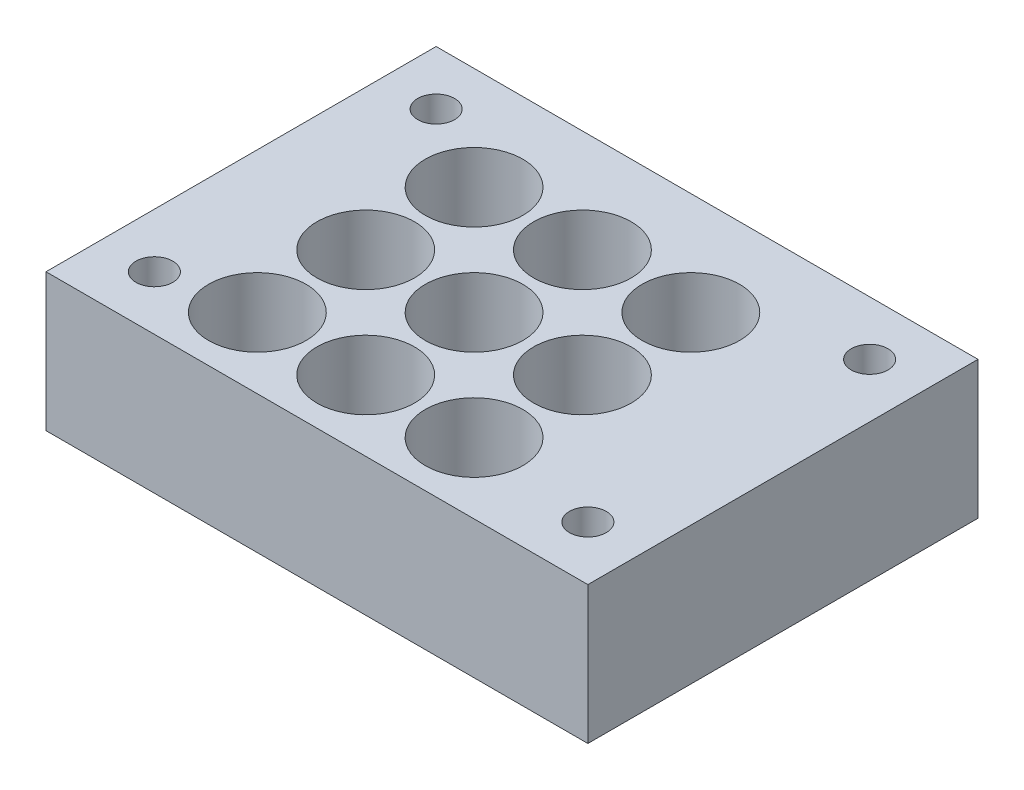
ISO-10303-21;
HEADER;
FILE_DESCRIPTION(('STEP AP214'),'2;1');
FILE_NAME('part.step','',(''),(''),'','','');
FILE_SCHEMA(('AUTOMOTIVE_DESIGN { 1 0 10303 214 1 1 1 1 }'));
ENDSEC;
DATA;
#1=APPLICATION_CONTEXT('core data for automotive mechanical design processes');
#2=APPLICATION_PROTOCOL_DEFINITION('international standard','automotive_design',2000,#1);
#3=PRODUCT_CONTEXT('',#1,'mechanical');
#4=PRODUCT('Part','Part','',(#3));
#5=PRODUCT_RELATED_PRODUCT_CATEGORY('part','',(#4));
#6=PRODUCT_DEFINITION_FORMATION('','',#4);
#7=PRODUCT_DEFINITION_CONTEXT('part definition',#1,'design');
#8=PRODUCT_DEFINITION('design','',#6,#7);
#9=PRODUCT_DEFINITION_SHAPE('','',#8);
#10=(LENGTH_UNIT() NAMED_UNIT(*) SI_UNIT(.MILLI.,.METRE.));
#11=(NAMED_UNIT(*) PLANE_ANGLE_UNIT() SI_UNIT($,.RADIAN.));
#12=(NAMED_UNIT(*) SI_UNIT($,.STERADIAN.) SOLID_ANGLE_UNIT());
#13=UNCERTAINTY_MEASURE_WITH_UNIT(LENGTH_MEASURE(1.E-05),#10,'distance_accuracy_value','');
#14=(GEOMETRIC_REPRESENTATION_CONTEXT(3) GLOBAL_UNCERTAINTY_ASSIGNED_CONTEXT((#13)) GLOBAL_UNIT_ASSIGNED_CONTEXT((#10,
#11,#12)) REPRESENTATION_CONTEXT('',''));
#15=CARTESIAN_POINT('',(0.,0.,0.));
#16=DIRECTION('',(0.,0.,1.));
#17=DIRECTION('',(1.,0.,0.));
#18=AXIS2_PLACEMENT_3D('',#15,#16,#17);
#19=CARTESIAN_POINT('',(0.,12.7,0.));
#20=DIRECTION('',(0.,0.,-1.));
#21=DIRECTION('',(-1.,0.,0.));
#22=AXIS2_PLACEMENT_3D('',#19,#20,#21);
#23=PLANE('',#22);
#24=DIRECTION('',(1.,0.,0.));
#25=VECTOR('',#24,1.);
#26=CARTESIAN_POINT('',(0.,0.,0.));
#27=LINE('',#26,#25);
#28=CARTESIAN_POINT('',(0.,0.,0.));
#29=VERTEX_POINT('',#28);
#30=CARTESIAN_POINT('',(50.,0.,0.));
#31=VERTEX_POINT('',#30);
#32=EDGE_CURVE('E147',#29,#31,#27,.T.);
#33=ORIENTED_EDGE('',*,*,#32,.T.);
#34=DIRECTION('',(0.,-1.,0.));
#35=VECTOR('',#34,1.);
#36=CARTESIAN_POINT('',(50.,12.7,0.));
#37=LINE('',#36,#35);
#38=CARTESIAN_POINT('',(50.,12.7,0.));
#39=VERTEX_POINT('',#38);
#40=EDGE_CURVE('E11',#39,#31,#37,.T.);
#41=ORIENTED_EDGE('',*,*,#40,.F.);
#42=DIRECTION('',(1.,0.,0.));
#43=VECTOR('',#42,1.);
#44=CARTESIAN_POINT('',(0.,12.7,0.));
#45=LINE('',#44,#43);
#46=CARTESIAN_POINT('',(0.,12.7,0.));
#47=VERTEX_POINT('',#46);
#48=EDGE_CURVE('E94',#47,#39,#45,.T.);
#49=ORIENTED_EDGE('',*,*,#48,.F.);
#50=DIRECTION('',(0.,-1.,0.));
#51=VECTOR('',#50,1.);
#52=CARTESIAN_POINT('',(0.,12.7,0.));
#53=LINE('',#52,#51);
#54=EDGE_CURVE('E61',#47,#29,#53,.T.);
#55=ORIENTED_EDGE('',*,*,#54,.T.);
#56=EDGE_LOOP('',(#33,#41,#49,#55));
#57=FACE_BOUND('',#56,.T.);
#58=ADVANCED_FACE('F44',(#57),#23,.F.);
#59=CARTESIAN_POINT('',(50.,12.7,0.));
#60=DIRECTION('',(-1.,0.,0.));
#61=DIRECTION('',(0.,0.,1.));
#62=AXIS2_PLACEMENT_3D('',#59,#60,#61);
#63=PLANE('',#62);
#64=DIRECTION('',(0.,0.,-1.));
#65=VECTOR('',#64,1.);
#66=CARTESIAN_POINT('',(50.,0.,0.));
#67=LINE('',#66,#65);
#68=CARTESIAN_POINT('',(50.,0.,-36.));
#69=VERTEX_POINT('',#68);
#70=EDGE_CURVE('E99',#31,#69,#67,.T.);
#71=ORIENTED_EDGE('',*,*,#70,.T.);
#72=DIRECTION('',(0.,-1.,0.));
#73=VECTOR('',#72,1.);
#74=CARTESIAN_POINT('',(50.,12.7,-36.));
#75=LINE('',#74,#73);
#76=CARTESIAN_POINT('',(50.,12.7,-36.));
#77=VERTEX_POINT('',#76);
#78=EDGE_CURVE('E53',#77,#69,#75,.T.);
#79=ORIENTED_EDGE('',*,*,#78,.F.);
#80=DIRECTION('',(0.,0.,-1.));
#81=VECTOR('',#80,1.);
#82=CARTESIAN_POINT('',(50.,12.7,0.));
#83=LINE('',#82,#81);
#84=EDGE_CURVE('E86',#39,#77,#83,.T.);
#85=ORIENTED_EDGE('',*,*,#84,.F.);
#86=ORIENTED_EDGE('',*,*,#40,.T.);
#87=EDGE_LOOP('',(#71,#79,#85,#86));
#88=FACE_BOUND('',#87,.T.);
#89=ADVANCED_FACE('F98',(#88),#63,.F.);
#90=CARTESIAN_POINT('',(0.,12.7,-36.));
#91=DIRECTION('',(0.,0.,-1.));
#92=DIRECTION('',(-1.,0.,0.));
#93=AXIS2_PLACEMENT_3D('',#90,#91,#92);
#94=PLANE('',#93);
#95=DIRECTION('',(1.,0.,0.));
#96=VECTOR('',#95,1.);
#97=CARTESIAN_POINT('',(0.,0.,-36.));
#98=LINE('',#97,#96);
#99=CARTESIAN_POINT('',(0.,0.,-36.));
#100=VERTEX_POINT('',#99);
#101=EDGE_CURVE('E150',#100,#69,#98,.T.);
#102=ORIENTED_EDGE('',*,*,#101,.F.);
#103=DIRECTION('',(0.,-1.,0.));
#104=VECTOR('',#103,1.);
#105=CARTESIAN_POINT('',(0.,12.7,-36.));
#106=LINE('',#105,#104);
#107=CARTESIAN_POINT('',(0.,12.7,-36.));
#108=VERTEX_POINT('',#107);
#109=EDGE_CURVE('E75',#108,#100,#106,.T.);
#110=ORIENTED_EDGE('',*,*,#109,.F.);
#111=DIRECTION('',(1.,0.,0.));
#112=VECTOR('',#111,1.);
#113=CARTESIAN_POINT('',(0.,12.7,-36.));
#114=LINE('',#113,#112);
#115=EDGE_CURVE('E93',#108,#77,#114,.T.);
#116=ORIENTED_EDGE('',*,*,#115,.T.);
#117=ORIENTED_EDGE('',*,*,#78,.T.);
#118=EDGE_LOOP('',(#102,#110,#116,#117));
#119=FACE_BOUND('',#118,.T.);
#120=ADVANCED_FACE('F102',(#119),#94,.T.);
#121=CARTESIAN_POINT('',(13.,12.7,-6.5));
#122=DIRECTION('',(0.,-1.,0.));
#123=DIRECTION('',(0.,0.,-1.));
#124=AXIS2_PLACEMENT_3D('',#121,#122,#123);
#125=CYLINDRICAL_SURFACE('',#124,4.5);
#126=CARTESIAN_POINT('',(13.,12.7,-6.5));
#127=DIRECTION('',(0.,1.,0.));
#128=DIRECTION('',(0.,0.,1.));
#129=AXIS2_PLACEMENT_3D('',#126,#127,#128);
#130=CIRCLE('',#129,4.5);
#131=CARTESIAN_POINT('',(13.,12.7,-1.99999999999999));
#132=VERTEX_POINT('',#131);
#133=EDGE_CURVE('E196',#132,#132,#130,.T.);
#134=ORIENTED_EDGE('',*,*,#133,.T.);
#135=EDGE_LOOP('',(#134));
#136=FACE_BOUND('',#135,.T.);
#137=CARTESIAN_POINT('',(13.,0.,-6.5));
#138=DIRECTION('',(0.,1.,0.));
#139=DIRECTION('',(0.,0.,1.));
#140=AXIS2_PLACEMENT_3D('',#137,#138,#139);
#141=CIRCLE('',#140,4.5);
#142=CARTESIAN_POINT('',(13.,0.,-1.99999999999999));
#143=VERTEX_POINT('',#142);
#144=EDGE_CURVE('E144',#143,#143,#141,.T.);
#145=ORIENTED_EDGE('',*,*,#144,.F.);
#146=EDGE_LOOP('',(#145));
#147=FACE_BOUND('',#146,.T.);
#148=ADVANCED_FACE('F200',(#136,#147),#125,.F.);
#149=CARTESIAN_POINT('',(5.,12.7,-5.));
#150=DIRECTION('',(0.,-1.,0.));
#151=DIRECTION('',(0.,0.,-1.));
#152=AXIS2_PLACEMENT_3D('',#149,#150,#151);
#153=CYLINDRICAL_SURFACE('',#152,1.7);
#154=CARTESIAN_POINT('',(5.,12.7,-5.));
#155=DIRECTION('',(0.,1.,0.));
#156=DIRECTION('',(0.,0.,1.));
#157=AXIS2_PLACEMENT_3D('',#154,#155,#156);
#158=CIRCLE('',#157,1.7);
#159=CARTESIAN_POINT('',(5.,12.7,-3.3));
#160=VERTEX_POINT('',#159);
#161=EDGE_CURVE('E193',#160,#160,#158,.T.);
#162=ORIENTED_EDGE('',*,*,#161,.T.);
#163=EDGE_LOOP('',(#162));
#164=FACE_BOUND('',#163,.T.);
#165=CARTESIAN_POINT('',(5.,0.,-5.));
#166=DIRECTION('',(0.,1.,0.));
#167=DIRECTION('',(0.,0.,1.));
#168=AXIS2_PLACEMENT_3D('',#165,#166,#167);
#169=CIRCLE('',#168,1.7);
#170=CARTESIAN_POINT('',(5.,0.,-3.3));
#171=VERTEX_POINT('',#170);
#172=EDGE_CURVE('E141',#171,#171,#169,.T.);
#173=ORIENTED_EDGE('',*,*,#172,.F.);
#174=EDGE_LOOP('',(#173));
#175=FACE_BOUND('',#174,.T.);
#176=ADVANCED_FACE('F226',(#164,#175),#153,.F.);
#177=CARTESIAN_POINT('',(5.,12.7,-31.));
#178=DIRECTION('',(0.,-1.,0.));
#179=DIRECTION('',(0.,0.,-1.));
#180=AXIS2_PLACEMENT_3D('',#177,#178,#179);
#181=CYLINDRICAL_SURFACE('',#180,1.7);
#182=CARTESIAN_POINT('',(5.,12.7,-31.));
#183=DIRECTION('',(0.,1.,0.));
#184=DIRECTION('',(0.,0.,1.));
#185=AXIS2_PLACEMENT_3D('',#182,#183,#184);
#186=CIRCLE('',#185,1.7);
#187=CARTESIAN_POINT('',(5.,12.7,-29.3));
#188=VERTEX_POINT('',#187);
#189=EDGE_CURVE('E190',#188,#188,#186,.T.);
#190=ORIENTED_EDGE('',*,*,#189,.T.);
#191=EDGE_LOOP('',(#190));
#192=FACE_BOUND('',#191,.T.);
#193=CARTESIAN_POINT('',(5.,0.,-31.));
#194=DIRECTION('',(0.,1.,0.));
#195=DIRECTION('',(0.,0.,1.));
#196=AXIS2_PLACEMENT_3D('',#193,#194,#195);
#197=CIRCLE('',#196,1.7);
#198=CARTESIAN_POINT('',(5.,0.,-29.3));
#199=VERTEX_POINT('',#198);
#200=EDGE_CURVE('E138',#199,#199,#197,.T.);
#201=ORIENTED_EDGE('',*,*,#200,.F.);
#202=EDGE_LOOP('',(#201));
#203=FACE_BOUND('',#202,.T.);
#204=ADVANCED_FACE('F229',(#192,#203),#181,.F.);
#205=CARTESIAN_POINT('',(45.,12.7,-31.));
#206=DIRECTION('',(0.,-1.,0.));
#207=DIRECTION('',(0.,0.,-1.));
#208=AXIS2_PLACEMENT_3D('',#205,#206,#207);
#209=CYLINDRICAL_SURFACE('',#208,1.7);
#210=CARTESIAN_POINT('',(45.,12.7,-31.));
#211=DIRECTION('',(0.,1.,0.));
#212=DIRECTION('',(0.,0.,1.));
#213=AXIS2_PLACEMENT_3D('',#210,#211,#212);
#214=CIRCLE('',#213,1.7);
#215=CARTESIAN_POINT('',(45.,12.7,-29.3));
#216=VERTEX_POINT('',#215);
#217=EDGE_CURVE('E187',#216,#216,#214,.T.);
#218=ORIENTED_EDGE('',*,*,#217,.T.);
#219=EDGE_LOOP('',(#218));
#220=FACE_BOUND('',#219,.T.);
#221=CARTESIAN_POINT('',(45.,0.,-31.));
#222=DIRECTION('',(0.,1.,0.));
#223=DIRECTION('',(0.,0.,1.));
#224=AXIS2_PLACEMENT_3D('',#221,#222,#223);
#225=CIRCLE('',#224,1.7);
#226=CARTESIAN_POINT('',(45.,0.,-29.3));
#227=VERTEX_POINT('',#226);
#228=EDGE_CURVE('E135',#227,#227,#225,.T.);
#229=ORIENTED_EDGE('',*,*,#228,.F.);
#230=EDGE_LOOP('',(#229));
#231=FACE_BOUND('',#230,.T.);
#232=ADVANCED_FACE('F233',(#220,#231),#209,.F.);
#233=CARTESIAN_POINT('',(45.,12.7,-5.));
#234=DIRECTION('',(0.,-1.,0.));
#235=DIRECTION('',(0.,0.,-1.));
#236=AXIS2_PLACEMENT_3D('',#233,#234,#235);
#237=CYLINDRICAL_SURFACE('',#236,1.7);
#238=CARTESIAN_POINT('',(45.,12.7,-5.));
#239=DIRECTION('',(0.,1.,0.));
#240=DIRECTION('',(0.,0.,1.));
#241=AXIS2_PLACEMENT_3D('',#238,#239,#240);
#242=CIRCLE('',#241,1.7);
#243=CARTESIAN_POINT('',(45.,12.7,-3.3));
#244=VERTEX_POINT('',#243);
#245=EDGE_CURVE('E184',#244,#244,#242,.T.);
#246=ORIENTED_EDGE('',*,*,#245,.T.);
#247=EDGE_LOOP('',(#246));
#248=FACE_BOUND('',#247,.T.);
#249=CARTESIAN_POINT('',(45.,0.,-5.));
#250=DIRECTION('',(0.,1.,0.));
#251=DIRECTION('',(0.,0.,1.));
#252=AXIS2_PLACEMENT_3D('',#249,#250,#251);
#253=CIRCLE('',#252,1.7);
#254=CARTESIAN_POINT('',(45.,0.,-3.3));
#255=VERTEX_POINT('',#254);
#256=EDGE_CURVE('E132',#255,#255,#253,.T.);
#257=ORIENTED_EDGE('',*,*,#256,.F.);
#258=EDGE_LOOP('',(#257));
#259=FACE_BOUND('',#258,.T.);
#260=ADVANCED_FACE('F237',(#248,#259),#237,.F.);
#261=CARTESIAN_POINT('',(23.,12.7,-6.5));
#262=DIRECTION('',(0.,-1.,0.));
#263=DIRECTION('',(0.,0.,-1.));
#264=AXIS2_PLACEMENT_3D('',#261,#262,#263);
#265=CYLINDRICAL_SURFACE('',#264,4.5);
#266=CARTESIAN_POINT('',(23.,12.7,-6.5));
#267=DIRECTION('',(0.,1.,0.));
#268=DIRECTION('',(0.,0.,1.));
#269=AXIS2_PLACEMENT_3D('',#266,#267,#268);
#270=CIRCLE('',#269,4.5);
#271=CARTESIAN_POINT('',(23.,12.7,-1.99999999999999));
#272=VERTEX_POINT('',#271);
#273=EDGE_CURVE('E181',#272,#272,#270,.T.);
#274=ORIENTED_EDGE('',*,*,#273,.T.);
#275=EDGE_LOOP('',(#274));
#276=FACE_BOUND('',#275,.T.);
#277=CARTESIAN_POINT('',(23.,0.,-6.5));
#278=DIRECTION('',(0.,1.,0.));
#279=DIRECTION('',(0.,0.,1.));
#280=AXIS2_PLACEMENT_3D('',#277,#278,#279);
#281=CIRCLE('',#280,4.5);
#282=CARTESIAN_POINT('',(23.,0.,-1.99999999999999));
#283=VERTEX_POINT('',#282);
#284=EDGE_CURVE('E129',#283,#283,#281,.T.);
#285=ORIENTED_EDGE('',*,*,#284,.F.);
#286=EDGE_LOOP('',(#285));
#287=FACE_BOUND('',#286,.T.);
#288=ADVANCED_FACE('F241',(#276,#287),#265,.F.);
#289=CARTESIAN_POINT('',(33.,12.7,-6.5));
#290=DIRECTION('',(0.,-1.,0.));
#291=DIRECTION('',(0.,0.,-1.));
#292=AXIS2_PLACEMENT_3D('',#289,#290,#291);
#293=CYLINDRICAL_SURFACE('',#292,4.5);
#294=CARTESIAN_POINT('',(33.,12.7,-6.5));
#295=DIRECTION('',(0.,1.,0.));
#296=DIRECTION('',(0.,0.,1.));
#297=AXIS2_PLACEMENT_3D('',#294,#295,#296);
#298=CIRCLE('',#297,4.5);
#299=CARTESIAN_POINT('',(33.,12.7,-1.99999999999999));
#300=VERTEX_POINT('',#299);
#301=EDGE_CURVE('E178',#300,#300,#298,.T.);
#302=ORIENTED_EDGE('',*,*,#301,.T.);
#303=EDGE_LOOP('',(#302));
#304=FACE_BOUND('',#303,.T.);
#305=CARTESIAN_POINT('',(33.,0.,-6.5));
#306=DIRECTION('',(0.,1.,0.));
#307=DIRECTION('',(0.,0.,1.));
#308=AXIS2_PLACEMENT_3D('',#305,#306,#307);
#309=CIRCLE('',#308,4.5);
#310=CARTESIAN_POINT('',(33.,0.,-1.99999999999999));
#311=VERTEX_POINT('',#310);
#312=EDGE_CURVE('E126',#311,#311,#309,.T.);
#313=ORIENTED_EDGE('',*,*,#312,.F.);
#314=EDGE_LOOP('',(#313));
#315=FACE_BOUND('',#314,.T.);
#316=ADVANCED_FACE('F245',(#304,#315),#293,.F.);
#317=CARTESIAN_POINT('',(23.,12.7,-16.5));
#318=DIRECTION('',(0.,-1.,0.));
#319=DIRECTION('',(0.,0.,-1.));
#320=AXIS2_PLACEMENT_3D('',#317,#318,#319);
#321=CYLINDRICAL_SURFACE('',#320,4.5);
#322=CARTESIAN_POINT('',(23.,12.7,-16.5));
#323=DIRECTION('',(0.,1.,0.));
#324=DIRECTION('',(0.,0.,1.));
#325=AXIS2_PLACEMENT_3D('',#322,#323,#324);
#326=CIRCLE('',#325,4.5);
#327=CARTESIAN_POINT('',(23.,12.7,-12.));
#328=VERTEX_POINT('',#327);
#329=EDGE_CURVE('E175',#328,#328,#326,.T.);
#330=ORIENTED_EDGE('',*,*,#329,.T.);
#331=EDGE_LOOP('',(#330));
#332=FACE_BOUND('',#331,.T.);
#333=CARTESIAN_POINT('',(23.,0.,-16.5));
#334=DIRECTION('',(0.,1.,0.));
#335=DIRECTION('',(0.,0.,1.));
#336=AXIS2_PLACEMENT_3D('',#333,#334,#335);
#337=CIRCLE('',#336,4.5);
#338=CARTESIAN_POINT('',(23.,0.,-12.));
#339=VERTEX_POINT('',#338);
#340=EDGE_CURVE('E123',#339,#339,#337,.T.);
#341=ORIENTED_EDGE('',*,*,#340,.F.);
#342=EDGE_LOOP('',(#341));
#343=FACE_BOUND('',#342,.T.);
#344=ADVANCED_FACE('F249',(#332,#343),#321,.F.);
#345=CARTESIAN_POINT('',(33.,12.7,-16.5));
#346=DIRECTION('',(0.,-1.,0.));
#347=DIRECTION('',(0.,0.,-1.));
#348=AXIS2_PLACEMENT_3D('',#345,#346,#347);
#349=CYLINDRICAL_SURFACE('',#348,4.5);
#350=CARTESIAN_POINT('',(33.,12.7,-16.5));
#351=DIRECTION('',(0.,1.,0.));
#352=DIRECTION('',(0.,0.,1.));
#353=AXIS2_PLACEMENT_3D('',#350,#351,#352);
#354=CIRCLE('',#353,4.5);
#355=CARTESIAN_POINT('',(33.,12.7,-12.));
#356=VERTEX_POINT('',#355);
#357=EDGE_CURVE('E172',#356,#356,#354,.T.);
#358=ORIENTED_EDGE('',*,*,#357,.T.);
#359=EDGE_LOOP('',(#358));
#360=FACE_BOUND('',#359,.T.);
#361=CARTESIAN_POINT('',(33.,0.,-16.5));
#362=DIRECTION('',(0.,1.,0.));
#363=DIRECTION('',(0.,0.,1.));
#364=AXIS2_PLACEMENT_3D('',#361,#362,#363);
#365=CIRCLE('',#364,4.5);
#366=CARTESIAN_POINT('',(33.,0.,-12.));
#367=VERTEX_POINT('',#366);
#368=EDGE_CURVE('E120',#367,#367,#365,.T.);
#369=ORIENTED_EDGE('',*,*,#368,.F.);
#370=EDGE_LOOP('',(#369));
#371=FACE_BOUND('',#370,.T.);
#372=ADVANCED_FACE('F253',(#360,#371),#349,.F.);
#373=CARTESIAN_POINT('',(22.9999999999999,12.7,-26.5));
#374=DIRECTION('',(0.,-1.,0.));
#375=DIRECTION('',(0.,0.,-1.));
#376=AXIS2_PLACEMENT_3D('',#373,#374,#375);
#377=CYLINDRICAL_SURFACE('',#376,4.50000000000001);
#378=CARTESIAN_POINT('',(22.9999999999999,12.7,-26.5));
#379=DIRECTION('',(0.,1.,0.));
#380=DIRECTION('',(0.,0.,1.));
#381=AXIS2_PLACEMENT_3D('',#378,#379,#380);
#382=CIRCLE('',#381,4.50000000000001);
#383=CARTESIAN_POINT('',(22.9999999999999,12.7,-22.));
#384=VERTEX_POINT('',#383);
#385=EDGE_CURVE('E169',#384,#384,#382,.T.);
#386=ORIENTED_EDGE('',*,*,#385,.T.);
#387=EDGE_LOOP('',(#386));
#388=FACE_BOUND('',#387,.T.);
#389=CARTESIAN_POINT('',(22.9999999999999,0.,-26.5));
#390=DIRECTION('',(0.,1.,0.));
#391=DIRECTION('',(0.,0.,1.));
#392=AXIS2_PLACEMENT_3D('',#389,#390,#391);
#393=CIRCLE('',#392,4.50000000000001);
#394=CARTESIAN_POINT('',(22.9999999999999,0.,-22.));
#395=VERTEX_POINT('',#394);
#396=EDGE_CURVE('E117',#395,#395,#393,.T.);
#397=ORIENTED_EDGE('',*,*,#396,.F.);
#398=EDGE_LOOP('',(#397));
#399=FACE_BOUND('',#398,.T.);
#400=ADVANCED_FACE('F257',(#388,#399),#377,.F.);
#401=CARTESIAN_POINT('',(32.9999999999999,12.7,-26.5));
#402=DIRECTION('',(0.,-1.,0.));
#403=DIRECTION('',(0.,0.,-1.));
#404=AXIS2_PLACEMENT_3D('',#401,#402,#403);
#405=CYLINDRICAL_SURFACE('',#404,4.5);
#406=CARTESIAN_POINT('',(32.9999999999999,12.7,-26.5));
#407=DIRECTION('',(0.,1.,0.));
#408=DIRECTION('',(0.,0.,1.));
#409=AXIS2_PLACEMENT_3D('',#406,#407,#408);
#410=CIRCLE('',#409,4.5);
#411=CARTESIAN_POINT('',(32.9999999999999,12.7,-22.));
#412=VERTEX_POINT('',#411);
#413=EDGE_CURVE('E164',#412,#412,#410,.T.);
#414=ORIENTED_EDGE('',*,*,#413,.T.);
#415=EDGE_LOOP('',(#414));
#416=FACE_BOUND('',#415,.T.);
#417=CARTESIAN_POINT('',(32.9999999999999,0.,-26.5));
#418=DIRECTION('',(0.,1.,0.));
#419=DIRECTION('',(0.,0.,1.));
#420=AXIS2_PLACEMENT_3D('',#417,#418,#419);
#421=CIRCLE('',#420,4.5);
#422=CARTESIAN_POINT('',(32.9999999999999,0.,-22.));
#423=VERTEX_POINT('',#422);
#424=EDGE_CURVE('E114',#423,#423,#421,.T.);
#425=ORIENTED_EDGE('',*,*,#424,.F.);
#426=EDGE_LOOP('',(#425));
#427=FACE_BOUND('',#426,.T.);
#428=ADVANCED_FACE('F261',(#416,#427),#405,.F.);
#429=CARTESIAN_POINT('',(13.,12.7,-16.5));
#430=DIRECTION('',(0.,-1.,0.));
#431=DIRECTION('',(0.,0.,-1.));
#432=AXIS2_PLACEMENT_3D('',#429,#430,#431);
#433=CYLINDRICAL_SURFACE('',#432,4.5);
#434=CARTESIAN_POINT('',(13.,12.7,-16.5));
#435=DIRECTION('',(0.,1.,0.));
#436=DIRECTION('',(0.,0.,1.));
#437=AXIS2_PLACEMENT_3D('',#434,#435,#436);
#438=CIRCLE('',#437,4.5);
#439=CARTESIAN_POINT('',(13.,12.7,-12.));
#440=VERTEX_POINT('',#439);
#441=EDGE_CURVE('E159',#440,#440,#438,.T.);
#442=ORIENTED_EDGE('',*,*,#441,.T.);
#443=EDGE_LOOP('',(#442));
#444=FACE_BOUND('',#443,.T.);
#445=CARTESIAN_POINT('',(13.,0.,-16.5));
#446=DIRECTION('',(0.,1.,0.));
#447=DIRECTION('',(0.,0.,1.));
#448=AXIS2_PLACEMENT_3D('',#445,#446,#447);
#449=CIRCLE('',#448,4.5);
#450=CARTESIAN_POINT('',(13.,0.,-12.));
#451=VERTEX_POINT('',#450);
#452=EDGE_CURVE('E111',#451,#451,#449,.T.);
#453=ORIENTED_EDGE('',*,*,#452,.F.);
#454=EDGE_LOOP('',(#453));
#455=FACE_BOUND('',#454,.T.);
#456=ADVANCED_FACE('F264',(#444,#455),#433,.F.);
#457=CARTESIAN_POINT('',(12.9999999999999,12.7,-26.5));
#458=DIRECTION('',(0.,-1.,0.));
#459=DIRECTION('',(0.,0.,-1.));
#460=AXIS2_PLACEMENT_3D('',#457,#458,#459);
#461=CYLINDRICAL_SURFACE('',#460,4.5);
#462=CARTESIAN_POINT('',(12.9999999999999,12.7,-26.5));
#463=DIRECTION('',(0.,1.,0.));
#464=DIRECTION('',(0.,0.,1.));
#465=AXIS2_PLACEMENT_3D('',#462,#463,#464);
#466=CIRCLE('',#465,4.5);
#467=CARTESIAN_POINT('',(12.9999999999999,12.7,-22.));
#468=VERTEX_POINT('',#467);
#469=EDGE_CURVE('E155',#468,#468,#466,.T.);
#470=ORIENTED_EDGE('',*,*,#469,.T.);
#471=EDGE_LOOP('',(#470));
#472=FACE_BOUND('',#471,.T.);
#473=CARTESIAN_POINT('',(12.9999999999999,0.,-26.5));
#474=DIRECTION('',(0.,1.,0.));
#475=DIRECTION('',(0.,0.,1.));
#476=AXIS2_PLACEMENT_3D('',#473,#474,#475);
#477=CIRCLE('',#476,4.5);
#478=CARTESIAN_POINT('',(12.9999999999999,0.,-22.));
#479=VERTEX_POINT('',#478);
#480=EDGE_CURVE('E108',#479,#479,#477,.T.);
#481=ORIENTED_EDGE('',*,*,#480,.F.);
#482=EDGE_LOOP('',(#481));
#483=FACE_BOUND('',#482,.T.);
#484=ADVANCED_FACE('F46',(#472,#483),#461,.F.);
#485=CARTESIAN_POINT('',(0.,12.7,0.));
#486=DIRECTION('',(-1.,0.,0.));
#487=DIRECTION('',(0.,0.,1.));
#488=AXIS2_PLACEMENT_3D('',#485,#486,#487);
#489=PLANE('',#488);
#490=DIRECTION('',(0.,0.,-1.));
#491=VECTOR('',#490,1.);
#492=CARTESIAN_POINT('',(0.,0.,0.));
#493=LINE('',#492,#491);
#494=EDGE_CURVE('E152',#29,#100,#493,.T.);
#495=ORIENTED_EDGE('',*,*,#494,.F.);
#496=ORIENTED_EDGE('',*,*,#54,.F.);
#497=DIRECTION('',(0.,0.,-1.));
#498=VECTOR('',#497,1.);
#499=CARTESIAN_POINT('',(0.,12.7,0.));
#500=LINE('',#499,#498);
#501=EDGE_CURVE('E103',#47,#108,#500,.T.);
#502=ORIENTED_EDGE('',*,*,#501,.T.);
#503=ORIENTED_EDGE('',*,*,#109,.T.);
#504=EDGE_LOOP('',(#495,#496,#502,#503));
#505=FACE_BOUND('',#504,.T.);
#506=ADVANCED_FACE('F205',(#505),#489,.T.);
#507=CARTESIAN_POINT('',(0.,12.7,0.));
#508=DIRECTION('',(0.,1.,0.));
#509=DIRECTION('',(0.,0.,1.));
#510=AXIS2_PLACEMENT_3D('',#507,#508,#509);
#511=PLANE('',#510);
#512=ORIENTED_EDGE('',*,*,#469,.F.);
#513=EDGE_LOOP('',(#512));
#514=FACE_BOUND('',#513,.T.);
#515=ORIENTED_EDGE('',*,*,#441,.F.);
#516=EDGE_LOOP('',(#515));
#517=FACE_BOUND('',#516,.T.);
#518=ORIENTED_EDGE('',*,*,#413,.F.);
#519=EDGE_LOOP('',(#518));
#520=FACE_BOUND('',#519,.T.);
#521=ORIENTED_EDGE('',*,*,#385,.F.);
#522=EDGE_LOOP('',(#521));
#523=FACE_BOUND('',#522,.T.);
#524=ORIENTED_EDGE('',*,*,#357,.F.);
#525=EDGE_LOOP('',(#524));
#526=FACE_BOUND('',#525,.T.);
#527=ORIENTED_EDGE('',*,*,#329,.F.);
#528=EDGE_LOOP('',(#527));
#529=FACE_BOUND('',#528,.T.);
#530=ORIENTED_EDGE('',*,*,#301,.F.);
#531=EDGE_LOOP('',(#530));
#532=FACE_BOUND('',#531,.T.);
#533=ORIENTED_EDGE('',*,*,#273,.F.);
#534=EDGE_LOOP('',(#533));
#535=FACE_BOUND('',#534,.T.);
#536=ORIENTED_EDGE('',*,*,#245,.F.);
#537=EDGE_LOOP('',(#536));
#538=FACE_BOUND('',#537,.T.);
#539=ORIENTED_EDGE('',*,*,#217,.F.);
#540=EDGE_LOOP('',(#539));
#541=FACE_BOUND('',#540,.T.);
#542=ORIENTED_EDGE('',*,*,#189,.F.);
#543=EDGE_LOOP('',(#542));
#544=FACE_BOUND('',#543,.T.);
#545=ORIENTED_EDGE('',*,*,#161,.F.);
#546=EDGE_LOOP('',(#545));
#547=FACE_BOUND('',#546,.T.);
#548=ORIENTED_EDGE('',*,*,#133,.F.);
#549=EDGE_LOOP('',(#548));
#550=FACE_BOUND('',#549,.T.);
#551=ORIENTED_EDGE('',*,*,#48,.T.);
#552=ORIENTED_EDGE('',*,*,#84,.T.);
#553=ORIENTED_EDGE('',*,*,#115,.F.);
#554=ORIENTED_EDGE('',*,*,#501,.F.);
#555=EDGE_LOOP('',(#551,#552,#553,#554));
#556=FACE_BOUND('',#555,.T.);
#557=ADVANCED_FACE('F90',(#514,#517,#520,#523,#526,#529,#532,#535,#538,#541,#544,#547,#550,
#556),#511,.T.);
#558=CARTESIAN_POINT('',(0.,0.,0.));
#559=DIRECTION('',(0.,1.,0.));
#560=DIRECTION('',(0.,0.,1.));
#561=AXIS2_PLACEMENT_3D('',#558,#559,#560);
#562=PLANE('',#561);
#563=ORIENTED_EDGE('',*,*,#480,.T.);
#564=EDGE_LOOP('',(#563));
#565=FACE_BOUND('',#564,.T.);
#566=ORIENTED_EDGE('',*,*,#452,.T.);
#567=EDGE_LOOP('',(#566));
#568=FACE_BOUND('',#567,.T.);
#569=ORIENTED_EDGE('',*,*,#424,.T.);
#570=EDGE_LOOP('',(#569));
#571=FACE_BOUND('',#570,.T.);
#572=ORIENTED_EDGE('',*,*,#396,.T.);
#573=EDGE_LOOP('',(#572));
#574=FACE_BOUND('',#573,.T.);
#575=ORIENTED_EDGE('',*,*,#368,.T.);
#576=EDGE_LOOP('',(#575));
#577=FACE_BOUND('',#576,.T.);
#578=ORIENTED_EDGE('',*,*,#340,.T.);
#579=EDGE_LOOP('',(#578));
#580=FACE_BOUND('',#579,.T.);
#581=ORIENTED_EDGE('',*,*,#312,.T.);
#582=EDGE_LOOP('',(#581));
#583=FACE_BOUND('',#582,.T.);
#584=ORIENTED_EDGE('',*,*,#284,.T.);
#585=EDGE_LOOP('',(#584));
#586=FACE_BOUND('',#585,.T.);
#587=ORIENTED_EDGE('',*,*,#256,.T.);
#588=EDGE_LOOP('',(#587));
#589=FACE_BOUND('',#588,.T.);
#590=ORIENTED_EDGE('',*,*,#228,.T.);
#591=EDGE_LOOP('',(#590));
#592=FACE_BOUND('',#591,.T.);
#593=ORIENTED_EDGE('',*,*,#200,.T.);
#594=EDGE_LOOP('',(#593));
#595=FACE_BOUND('',#594,.T.);
#596=ORIENTED_EDGE('',*,*,#172,.T.);
#597=EDGE_LOOP('',(#596));
#598=FACE_BOUND('',#597,.T.);
#599=ORIENTED_EDGE('',*,*,#144,.T.);
#600=EDGE_LOOP('',(#599));
#601=FACE_BOUND('',#600,.T.);
#602=ORIENTED_EDGE('',*,*,#32,.F.);
#603=ORIENTED_EDGE('',*,*,#494,.T.);
#604=ORIENTED_EDGE('',*,*,#101,.T.);
#605=ORIENTED_EDGE('',*,*,#70,.F.);
#606=EDGE_LOOP('',(#602,#603,#604,#605));
#607=FACE_BOUND('',#606,.T.);
#608=ADVANCED_FACE('F204',(#565,#568,#571,#574,#577,#580,#583,#586,#589,#592,#595,#598,#601,
#607),#562,.F.);
#609=CLOSED_SHELL('',(#58,#89,#120,#148,#176,#204,#232,#260,#288,#316,#344,#372,#400,#428,#456,
#484,#506,#557,#608));
#610=MANIFOLD_SOLID_BREP('B2',#609);
#611=ADVANCED_BREP_SHAPE_REPRESENTATION('',(#18,#610),#14);
#612=SHAPE_DEFINITION_REPRESENTATION(#9,#611);
ENDSEC;
END-ISO-10303-21;
